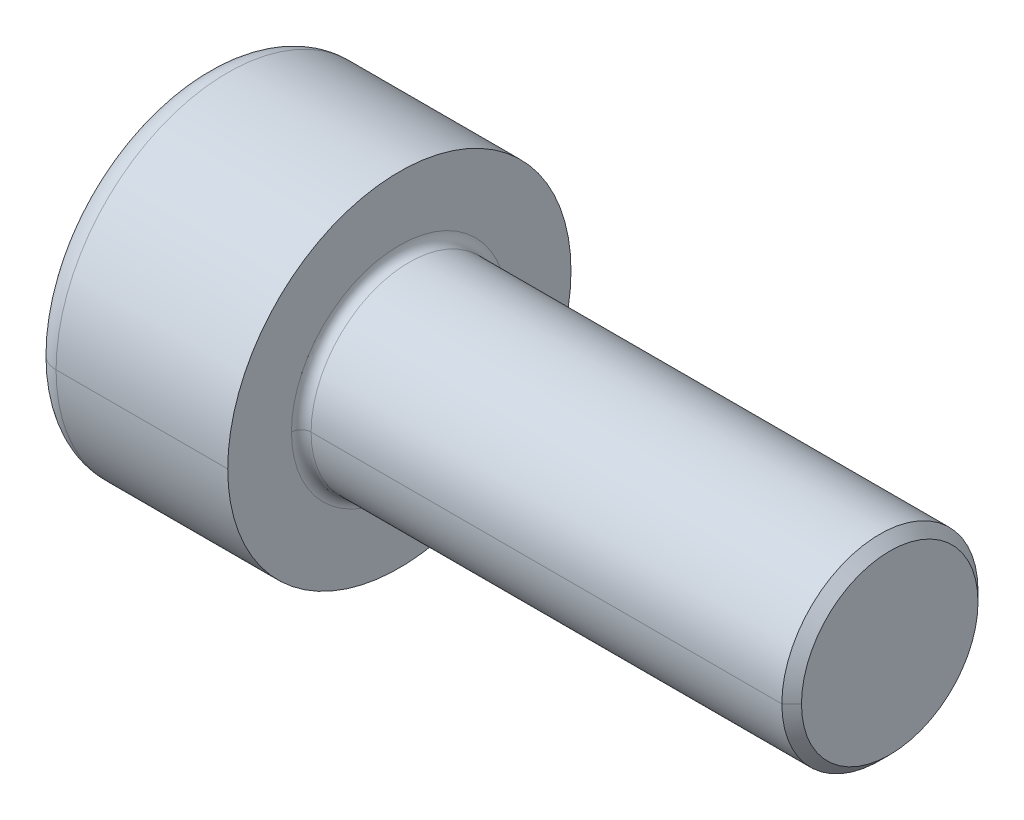
ISO-10303-21;
HEADER;
FILE_DESCRIPTION(('STEP AP214'),'2;1');
FILE_NAME('part.step','',(''),(''),'','','');
FILE_SCHEMA(('AUTOMOTIVE_DESIGN { 1 0 10303 214 1 1 1 1 }'));
ENDSEC;
DATA;
#1=APPLICATION_CONTEXT('core data for automotive mechanical design processes');
#2=APPLICATION_PROTOCOL_DEFINITION('international standard','automotive_design',2000,#1);
#3=PRODUCT_CONTEXT('',#1,'mechanical');
#4=PRODUCT('Part','Part','',(#3));
#5=PRODUCT_RELATED_PRODUCT_CATEGORY('part','',(#4));
#6=PRODUCT_DEFINITION_FORMATION('','',#4);
#7=PRODUCT_DEFINITION_CONTEXT('part definition',#1,'design');
#8=PRODUCT_DEFINITION('design','',#6,#7);
#9=PRODUCT_DEFINITION_SHAPE('','',#8);
#10=(LENGTH_UNIT() NAMED_UNIT(*) SI_UNIT(.MILLI.,.METRE.));
#11=(NAMED_UNIT(*) PLANE_ANGLE_UNIT() SI_UNIT($,.RADIAN.));
#12=(NAMED_UNIT(*) SI_UNIT($,.STERADIAN.) SOLID_ANGLE_UNIT());
#13=UNCERTAINTY_MEASURE_WITH_UNIT(LENGTH_MEASURE(1.E-05),#10,'distance_accuracy_value','');
#14=(GEOMETRIC_REPRESENTATION_CONTEXT(3) GLOBAL_UNCERTAINTY_ASSIGNED_CONTEXT((#13)) GLOBAL_UNIT_ASSIGNED_CONTEXT((#10,
#11,#12)) REPRESENTATION_CONTEXT('',''));
#15=CARTESIAN_POINT('',(0.,0.,0.));
#16=DIRECTION('',(0.,0.,1.));
#17=DIRECTION('',(1.,0.,0.));
#18=AXIS2_PLACEMENT_3D('',#15,#16,#17);
#19=CARTESIAN_POINT('',(0.,0.,0.));
#20=DIRECTION('',(1.,0.,0.));
#21=DIRECTION('',(0.,1.,0.));
#22=AXIS2_PLACEMENT_3D('',#19,#20,#21);
#23=PLANE('',#22);
#24=CARTESIAN_POINT('',(0.,0.,0.));
#25=DIRECTION('',(-1.,0.,0.));
#26=DIRECTION('',(0.,0.,-1.));
#27=AXIS2_PLACEMENT_3D('',#24,#25,#26);
#28=CIRCLE('',#27,3.);
#29=CARTESIAN_POINT('',(0.,0.,-3.));
#30=VERTEX_POINT('',#29);
#31=CARTESIAN_POINT('',(0.,0.,3.));
#32=VERTEX_POINT('',#31);
#33=EDGE_CURVE('E10',#30,#32,#28,.T.);
#34=ORIENTED_EDGE('',*,*,#33,.T.);
#35=CARTESIAN_POINT('',(0.,0.,0.));
#36=DIRECTION('',(-1.,0.,0.));
#37=DIRECTION('',(0.,0.,-1.));
#38=AXIS2_PLACEMENT_3D('',#35,#36,#37);
#39=CIRCLE('',#38,3.);
#40=EDGE_CURVE('E27',#32,#30,#39,.T.);
#41=ORIENTED_EDGE('',*,*,#40,.T.);
#42=EDGE_LOOP('',(#34,#41));
#43=FACE_BOUND('',#42,.T.);
#44=DIRECTION('',(0.,0.866025403784439,-0.5));
#45=VECTOR('',#44,1.);
#46=CARTESIAN_POINT('',(0.,-1.5,-0.866025403784437));
#47=LINE('',#46,#45);
#48=CARTESIAN_POINT('',(0.,-1.5,-0.866025403784437));
#49=VERTEX_POINT('',#48);
#50=CARTESIAN_POINT('',(0.,0.,-1.73205080756887));
#51=VERTEX_POINT('',#50);
#52=EDGE_CURVE('E195',#49,#51,#47,.T.);
#53=ORIENTED_EDGE('',*,*,#52,.T.);
#54=DIRECTION('',(0.,0.866025403784439,0.5));
#55=VECTOR('',#54,1.);
#56=CARTESIAN_POINT('',(0.,0.,-1.73205080756887));
#57=LINE('',#56,#55);
#58=CARTESIAN_POINT('',(0.,1.5,-0.866025403784437));
#59=VERTEX_POINT('',#58);
#60=EDGE_CURVE('E306',#51,#59,#57,.T.);
#61=ORIENTED_EDGE('',*,*,#60,.T.);
#62=DIRECTION('',(0.,0.,1.));
#63=VECTOR('',#62,1.);
#64=CARTESIAN_POINT('',(0.,1.5,-0.866025403784437));
#65=LINE('',#64,#63);
#66=CARTESIAN_POINT('',(0.,1.5,0.86602540378444));
#67=VERTEX_POINT('',#66);
#68=EDGE_CURVE('E310',#59,#67,#65,.T.);
#69=ORIENTED_EDGE('',*,*,#68,.T.);
#70=DIRECTION('',(0.,-0.866025403784439,0.5));
#71=VECTOR('',#70,1.);
#72=CARTESIAN_POINT('',(0.,1.5,0.86602540378444));
#73=LINE('',#72,#71);
#74=CARTESIAN_POINT('',(0.,0.,1.73205080756888));
#75=VERTEX_POINT('',#74);
#76=EDGE_CURVE('E332',#67,#75,#73,.T.);
#77=ORIENTED_EDGE('',*,*,#76,.T.);
#78=DIRECTION('',(0.,-0.866025403784439,-0.5));
#79=VECTOR('',#78,1.);
#80=CARTESIAN_POINT('',(0.,0.,1.73205080756888));
#81=LINE('',#80,#79);
#82=CARTESIAN_POINT('',(0.,-1.5,0.86602540378444));
#83=VERTEX_POINT('',#82);
#84=EDGE_CURVE('E292',#75,#83,#81,.T.);
#85=ORIENTED_EDGE('',*,*,#84,.T.);
#86=DIRECTION('',(0.,0.,-1.));
#87=VECTOR('',#86,1.);
#88=CARTESIAN_POINT('',(0.,-1.5,0.86602540378444));
#89=LINE('',#88,#87);
#90=EDGE_CURVE('E290',#83,#49,#89,.T.);
#91=ORIENTED_EDGE('',*,*,#90,.T.);
#92=EDGE_LOOP('',(#53,#61,#69,#77,#85,#91));
#93=FACE_BOUND('',#92,.T.);
#94=ADVANCED_FACE('F16',(#43,#93),#23,.F.);
#95=CARTESIAN_POINT('',(2.,1.5,-0.866025403784437));
#96=DIRECTION('',(0.,-1.,0.));
#97=DIRECTION('',(0.,0.,-1.));
#98=AXIS2_PLACEMENT_3D('',#95,#96,#97);
#99=PLANE('',#98);
#100=ORIENTED_EDGE('',*,*,#68,.F.);
#101=DIRECTION('',(-1.,0.,0.));
#102=VECTOR('',#101,1.);
#103=CARTESIAN_POINT('',(2.,1.5,-0.866025403784437));
#104=LINE('',#103,#102);
#105=CARTESIAN_POINT('',(2.,1.5,-0.866025403784437));
#106=VERTEX_POINT('',#105);
#107=EDGE_CURVE('E213',#106,#59,#104,.T.);
#108=ORIENTED_EDGE('',*,*,#107,.F.);
#109=DIRECTION('',(0.,0.,1.));
#110=VECTOR('',#109,1.);
#111=CARTESIAN_POINT('',(2.,1.5,-0.866025403784437));
#112=LINE('',#111,#110);
#113=CARTESIAN_POINT('',(2.,1.5,0.));
#114=VERTEX_POINT('',#113);
#115=EDGE_CURVE('E293',#106,#114,#112,.T.);
#116=ORIENTED_EDGE('',*,*,#115,.T.);
#117=DIRECTION('',(0.,0.,1.));
#118=VECTOR('',#117,1.);
#119=CARTESIAN_POINT('',(2.,1.5,-0.866025403784437));
#120=LINE('',#119,#118);
#121=CARTESIAN_POINT('',(2.,1.5,0.86602540378444));
#122=VERTEX_POINT('',#121);
#123=EDGE_CURVE('E275',#114,#122,#120,.T.);
#124=ORIENTED_EDGE('',*,*,#123,.T.);
#125=DIRECTION('',(-1.,0.,0.));
#126=VECTOR('',#125,1.);
#127=CARTESIAN_POINT('',(2.,1.5,0.86602540378444));
#128=LINE('',#127,#126);
#129=EDGE_CURVE('E360',#122,#67,#128,.T.);
#130=ORIENTED_EDGE('',*,*,#129,.T.);
#131=EDGE_LOOP('',(#100,#108,#116,#124,#130));
#132=FACE_BOUND('',#131,.T.);
#133=ADVANCED_FACE('F468',(#132),#99,.T.);
#134=CARTESIAN_POINT('',(0.5,0.,0.));
#135=DIRECTION('',(1.,0.,0.));
#136=DIRECTION('',(0.,0.,-1.));
#137=AXIS2_PLACEMENT_3D('',#134,#135,#136);
#138=TOROIDAL_SURFACE('',#137,3.,0.5);
#139=CARTESIAN_POINT('',(0.5,0.,3.));
#140=DIRECTION('',(0.,1.,0.));
#141=DIRECTION('',(0.,0.,1.));
#142=AXIS2_PLACEMENT_3D('',#139,#140,#141);
#143=CIRCLE('',#142,0.5);
#144=CARTESIAN_POINT('',(0.5,0.,3.5));
#145=VERTEX_POINT('',#144);
#146=EDGE_CURVE('E249',#32,#145,#143,.T.);
#147=ORIENTED_EDGE('',*,*,#146,.F.);
#148=ORIENTED_EDGE('',*,*,#33,.F.);
#149=CARTESIAN_POINT('',(0.5,0.,-3.));
#150=DIRECTION('',(0.,-1.,0.));
#151=DIRECTION('',(0.,0.,-1.));
#152=AXIS2_PLACEMENT_3D('',#149,#150,#151);
#153=CIRCLE('',#152,0.5);
#154=CARTESIAN_POINT('',(0.5,0.,-3.5));
#155=VERTEX_POINT('',#154);
#156=EDGE_CURVE('E357',#30,#155,#153,.T.);
#157=ORIENTED_EDGE('',*,*,#156,.T.);
#158=CARTESIAN_POINT('',(0.5,0.,0.));
#159=DIRECTION('',(1.,0.,0.));
#160=DIRECTION('',(0.,0.,-1.));
#161=AXIS2_PLACEMENT_3D('',#158,#159,#160);
#162=CIRCLE('',#161,3.5);
#163=EDGE_CURVE('E316',#145,#155,#162,.T.);
#164=ORIENTED_EDGE('',*,*,#163,.F.);
#165=EDGE_LOOP('',(#147,#148,#157,#164));
#166=FACE_BOUND('',#165,.T.);
#167=ADVANCED_FACE('F474',(#166),#138,.T.);
#168=CARTESIAN_POINT('',(2.,-1.5,0.86602540378444));
#169=DIRECTION('',(0.,1.,0.));
#170=DIRECTION('',(1.,0.,0.));
#171=AXIS2_PLACEMENT_3D('',#168,#169,#170);
#172=PLANE('',#171);
#173=ORIENTED_EDGE('',*,*,#90,.F.);
#174=DIRECTION('',(-1.,0.,0.));
#175=VECTOR('',#174,1.);
#176=CARTESIAN_POINT('',(2.,-1.5,0.86602540378444));
#177=LINE('',#176,#175);
#178=CARTESIAN_POINT('',(2.,-1.5,0.86602540378444));
#179=VERTEX_POINT('',#178);
#180=EDGE_CURVE('E300',#179,#83,#177,.T.);
#181=ORIENTED_EDGE('',*,*,#180,.F.);
#182=DIRECTION('',(0.,0.,-1.));
#183=VECTOR('',#182,1.);
#184=CARTESIAN_POINT('',(2.,-1.5,0.86602540378444));
#185=LINE('',#184,#183);
#186=CARTESIAN_POINT('',(2.,-1.5,0.));
#187=VERTEX_POINT('',#186);
#188=EDGE_CURVE('E205',#179,#187,#185,.T.);
#189=ORIENTED_EDGE('',*,*,#188,.T.);
#190=DIRECTION('',(0.,0.,-1.));
#191=VECTOR('',#190,1.);
#192=CARTESIAN_POINT('',(2.,-1.5,0.86602540378444));
#193=LINE('',#192,#191);
#194=CARTESIAN_POINT('',(2.,-1.5,-0.866025403784437));
#195=VERTEX_POINT('',#194);
#196=EDGE_CURVE('E198',#187,#195,#193,.T.);
#197=ORIENTED_EDGE('',*,*,#196,.T.);
#198=DIRECTION('',(-1.,0.,0.));
#199=VECTOR('',#198,1.);
#200=CARTESIAN_POINT('',(2.,-1.5,-0.866025403784437));
#201=LINE('',#200,#199);
#202=EDGE_CURVE('E187',#195,#49,#201,.T.);
#203=ORIENTED_EDGE('',*,*,#202,.T.);
#204=EDGE_LOOP('',(#173,#181,#189,#197,#203));
#205=FACE_BOUND('',#204,.T.);
#206=ADVANCED_FACE('F203',(#205),#172,.T.);
#207=CARTESIAN_POINT('',(2.,0.,1.73205080756888));
#208=DIRECTION('',(0.,0.5,-0.866025403784439));
#209=DIRECTION('',(-1.,0.,0.));
#210=AXIS2_PLACEMENT_3D('',#207,#208,#209);
#211=PLANE('',#210);
#212=ORIENTED_EDGE('',*,*,#84,.F.);
#213=DIRECTION('',(-1.,0.,0.));
#214=VECTOR('',#213,1.);
#215=CARTESIAN_POINT('',(2.,0.,1.73205080756888));
#216=LINE('',#215,#214);
#217=CARTESIAN_POINT('',(2.,0.,1.73205080756888));
#218=VERTEX_POINT('',#217);
#219=EDGE_CURVE('E289',#218,#75,#216,.T.);
#220=ORIENTED_EDGE('',*,*,#219,.F.);
#221=DIRECTION('',(0.,-0.866025403784439,-0.5));
#222=VECTOR('',#221,1.);
#223=CARTESIAN_POINT('',(2.,0.,1.73205080756888));
#224=LINE('',#223,#222);
#225=CARTESIAN_POINT('',(2.,-0.75,1.29903810567666));
#226=VERTEX_POINT('',#225);
#227=EDGE_CURVE('E199',#218,#226,#224,.T.);
#228=ORIENTED_EDGE('',*,*,#227,.T.);
#229=DIRECTION('',(0.,-0.866025403784439,-0.5));
#230=VECTOR('',#229,1.);
#231=CARTESIAN_POINT('',(2.,0.,1.73205080756888));
#232=LINE('',#231,#230);
#233=EDGE_CURVE('E304',#226,#179,#232,.T.);
#234=ORIENTED_EDGE('',*,*,#233,.T.);
#235=ORIENTED_EDGE('',*,*,#180,.T.);
#236=EDGE_LOOP('',(#212,#220,#228,#234,#235));
#237=FACE_BOUND('',#236,.T.);
#238=ADVANCED_FACE('F457',(#237),#211,.T.);
#239=CARTESIAN_POINT('',(2.,0.,-1.73205080756887));
#240=DIRECTION('',(0.,-0.5,0.866025403784439));
#241=DIRECTION('',(-1.,0.,0.));
#242=AXIS2_PLACEMENT_3D('',#239,#240,#241);
#243=PLANE('',#242);
#244=ORIENTED_EDGE('',*,*,#60,.F.);
#245=DIRECTION('',(-1.,0.,0.));
#246=VECTOR('',#245,1.);
#247=CARTESIAN_POINT('',(2.,0.,-1.73205080756887));
#248=LINE('',#247,#246);
#249=CARTESIAN_POINT('',(2.,0.,-1.73205080756887));
#250=VERTEX_POINT('',#249);
#251=EDGE_CURVE('E166',#250,#51,#248,.T.);
#252=ORIENTED_EDGE('',*,*,#251,.F.);
#253=DIRECTION('',(0.,0.866025403784439,0.5));
#254=VECTOR('',#253,1.);
#255=CARTESIAN_POINT('',(2.,0.,-1.73205080756887));
#256=LINE('',#255,#254);
#257=CARTESIAN_POINT('',(2.,0.75,-1.29903810567666));
#258=VERTEX_POINT('',#257);
#259=EDGE_CURVE('E305',#250,#258,#256,.T.);
#260=ORIENTED_EDGE('',*,*,#259,.T.);
#261=DIRECTION('',(0.,0.866025403784439,0.5));
#262=VECTOR('',#261,1.);
#263=CARTESIAN_POINT('',(2.,0.,-1.73205080756887));
#264=LINE('',#263,#262);
#265=EDGE_CURVE('E222',#258,#106,#264,.T.);
#266=ORIENTED_EDGE('',*,*,#265,.T.);
#267=ORIENTED_EDGE('',*,*,#107,.T.);
#268=EDGE_LOOP('',(#244,#252,#260,#266,#267));
#269=FACE_BOUND('',#268,.T.);
#270=ADVANCED_FACE('F455',(#269),#243,.T.);
#271=CARTESIAN_POINT('',(2.,-1.5,-0.866025403784437));
#272=DIRECTION('',(0.,0.5,0.866025403784439));
#273=DIRECTION('',(1.,0.,0.));
#274=AXIS2_PLACEMENT_3D('',#271,#272,#273);
#275=PLANE('',#274);
#276=ORIENTED_EDGE('',*,*,#52,.F.);
#277=ORIENTED_EDGE('',*,*,#202,.F.);
#278=DIRECTION('',(0.,0.866025403784439,-0.5));
#279=VECTOR('',#278,1.);
#280=CARTESIAN_POINT('',(2.,-1.5,-0.866025403784437));
#281=LINE('',#280,#279);
#282=CARTESIAN_POINT('',(2.,-0.75,-1.29903810567666));
#283=VERTEX_POINT('',#282);
#284=EDGE_CURVE('E192',#195,#283,#281,.T.);
#285=ORIENTED_EDGE('',*,*,#284,.T.);
#286=DIRECTION('',(0.,0.866025403784439,-0.5));
#287=VECTOR('',#286,1.);
#288=CARTESIAN_POINT('',(2.,-1.5,-0.866025403784437));
#289=LINE('',#288,#287);
#290=EDGE_CURVE('E214',#283,#250,#289,.T.);
#291=ORIENTED_EDGE('',*,*,#290,.T.);
#292=ORIENTED_EDGE('',*,*,#251,.T.);
#293=EDGE_LOOP('',(#276,#277,#285,#291,#292));
#294=FACE_BOUND('',#293,.T.);
#295=ADVANCED_FACE('F189',(#294),#275,.T.);
#296=CARTESIAN_POINT('',(2.,1.5,0.86602540378444));
#297=DIRECTION('',(0.,-0.5,-0.866025403784439));
#298=DIRECTION('',(0.,-0.866025403784439,0.5));
#299=AXIS2_PLACEMENT_3D('',#296,#297,#298);
#300=PLANE('',#299);
#301=ORIENTED_EDGE('',*,*,#76,.F.);
#302=ORIENTED_EDGE('',*,*,#129,.F.);
#303=DIRECTION('',(0.,-0.866025403784439,0.5));
#304=VECTOR('',#303,1.);
#305=CARTESIAN_POINT('',(2.,1.5,0.86602540378444));
#306=LINE('',#305,#304);
#307=CARTESIAN_POINT('',(2.,0.75,1.29903810567666));
#308=VERTEX_POINT('',#307);
#309=EDGE_CURVE('E355',#122,#308,#306,.T.);
#310=ORIENTED_EDGE('',*,*,#309,.T.);
#311=DIRECTION('',(0.,-0.866025403784439,0.5));
#312=VECTOR('',#311,1.);
#313=CARTESIAN_POINT('',(2.,1.5,0.86602540378444));
#314=LINE('',#313,#312);
#315=EDGE_CURVE('E228',#308,#218,#314,.T.);
#316=ORIENTED_EDGE('',*,*,#315,.T.);
#317=ORIENTED_EDGE('',*,*,#219,.T.);
#318=EDGE_LOOP('',(#301,#302,#310,#316,#317));
#319=FACE_BOUND('',#318,.T.);
#320=ADVANCED_FACE('F424',(#319),#300,.T.);
#321=CARTESIAN_POINT('',(0.5,0.,0.));
#322=DIRECTION('',(1.,0.,0.));
#323=DIRECTION('',(0.,0.,-1.));
#324=AXIS2_PLACEMENT_3D('',#321,#322,#323);
#325=TOROIDAL_SURFACE('',#324,3.,0.5);
#326=ORIENTED_EDGE('',*,*,#40,.F.);
#327=ORIENTED_EDGE('',*,*,#146,.T.);
#328=CARTESIAN_POINT('',(0.5,0.,0.));
#329=DIRECTION('',(1.,0.,0.));
#330=DIRECTION('',(0.,0.,-1.));
#331=AXIS2_PLACEMENT_3D('',#328,#329,#330);
#332=CIRCLE('',#331,3.5);
#333=EDGE_CURVE('E280',#155,#145,#332,.T.);
#334=ORIENTED_EDGE('',*,*,#333,.F.);
#335=ORIENTED_EDGE('',*,*,#156,.F.);
#336=EDGE_LOOP('',(#326,#327,#334,#335));
#337=FACE_BOUND('',#336,.T.);
#338=ADVANCED_FACE('F664',(#337),#325,.T.);
#339=CARTESIAN_POINT('',(2.,1.5,-2.59807621135332));
#340=DIRECTION('',(1.,0.,0.));
#341=DIRECTION('',(0.,1.,0.));
#342=AXIS2_PLACEMENT_3D('',#339,#340,#341);
#343=PLANE('',#342);
#344=ORIENTED_EDGE('',*,*,#123,.F.);
#345=CARTESIAN_POINT('',(2.,0.,0.));
#346=DIRECTION('',(1.,0.,0.));
#347=DIRECTION('',(0.,0.,-1.));
#348=AXIS2_PLACEMENT_3D('',#345,#346,#347);
#349=CIRCLE('',#348,1.5);
#350=EDGE_CURVE('E247',#114,#308,#349,.T.);
#351=ORIENTED_EDGE('',*,*,#350,.T.);
#352=ORIENTED_EDGE('',*,*,#309,.F.);
#353=EDGE_LOOP('',(#344,#351,#352));
#354=FACE_BOUND('',#353,.T.);
#355=ADVANCED_FACE('F668',(#354),#343,.F.);
#356=CARTESIAN_POINT('',(2.,1.5,-2.59807621135332));
#357=DIRECTION('',(1.,0.,0.));
#358=DIRECTION('',(0.,1.,0.));
#359=AXIS2_PLACEMENT_3D('',#356,#357,#358);
#360=PLANE('',#359);
#361=ORIENTED_EDGE('',*,*,#265,.F.);
#362=CARTESIAN_POINT('',(2.,0.,0.));
#363=DIRECTION('',(1.,0.,0.));
#364=DIRECTION('',(0.,0.,-1.));
#365=AXIS2_PLACEMENT_3D('',#362,#363,#364);
#366=CIRCLE('',#365,1.5);
#367=EDGE_CURVE('E250',#258,#114,#366,.T.);
#368=ORIENTED_EDGE('',*,*,#367,.T.);
#369=ORIENTED_EDGE('',*,*,#115,.F.);
#370=EDGE_LOOP('',(#361,#368,#369));
#371=FACE_BOUND('',#370,.T.);
#372=ADVANCED_FACE('F454',(#371),#360,.F.);
#373=CARTESIAN_POINT('',(4.,0.,0.));
#374=DIRECTION('',(-1.,0.,0.));
#375=DIRECTION('',(0.,0.,1.));
#376=AXIS2_PLACEMENT_3D('',#373,#374,#375);
#377=CYLINDRICAL_SURFACE('',#376,3.5);
#378=DIRECTION('',(-1.,0.,0.));
#379=VECTOR('',#378,1.);
#380=CARTESIAN_POINT('',(4.,0.,-3.5));
#381=LINE('',#380,#379);
#382=CARTESIAN_POINT('',(4.,0.,-3.5));
#383=VERTEX_POINT('',#382);
#384=EDGE_CURVE('E277',#383,#155,#381,.T.);
#385=ORIENTED_EDGE('',*,*,#384,.F.);
#386=CARTESIAN_POINT('',(4.,0.,0.));
#387=DIRECTION('',(1.,0.,0.));
#388=DIRECTION('',(0.,0.,-1.));
#389=AXIS2_PLACEMENT_3D('',#386,#387,#388);
#390=CIRCLE('',#389,3.5);
#391=CARTESIAN_POINT('',(4.,0.,3.5));
#392=VERTEX_POINT('',#391);
#393=EDGE_CURVE('E324',#392,#383,#390,.T.);
#394=ORIENTED_EDGE('',*,*,#393,.F.);
#395=DIRECTION('',(-1.,0.,0.));
#396=VECTOR('',#395,1.);
#397=CARTESIAN_POINT('',(4.,0.,3.5));
#398=LINE('',#397,#396);
#399=EDGE_CURVE('E320',#392,#145,#398,.T.);
#400=ORIENTED_EDGE('',*,*,#399,.T.);
#401=ORIENTED_EDGE('',*,*,#163,.T.);
#402=EDGE_LOOP('',(#385,#394,#400,#401));
#403=FACE_BOUND('',#402,.T.);
#404=ADVANCED_FACE('F18',(#403),#377,.T.);
#405=CARTESIAN_POINT('',(2.,1.5,-2.59807621135332));
#406=DIRECTION('',(1.,0.,0.));
#407=DIRECTION('',(0.,1.,0.));
#408=AXIS2_PLACEMENT_3D('',#405,#406,#407);
#409=PLANE('',#408);
#410=ORIENTED_EDGE('',*,*,#233,.F.);
#411=CARTESIAN_POINT('',(2.,0.,0.));
#412=DIRECTION('',(1.,0.,0.));
#413=DIRECTION('',(0.,0.,-1.));
#414=AXIS2_PLACEMENT_3D('',#411,#412,#413);
#415=CIRCLE('',#414,1.5);
#416=EDGE_CURVE('E177',#226,#187,#415,.T.);
#417=ORIENTED_EDGE('',*,*,#416,.T.);
#418=ORIENTED_EDGE('',*,*,#188,.F.);
#419=EDGE_LOOP('',(#410,#417,#418));
#420=FACE_BOUND('',#419,.T.);
#421=ADVANCED_FACE('F738',(#420),#409,.F.);
#422=CARTESIAN_POINT('',(2.,1.5,-2.59807621135332));
#423=DIRECTION('',(1.,0.,0.));
#424=DIRECTION('',(0.,1.,0.));
#425=AXIS2_PLACEMENT_3D('',#422,#423,#424);
#426=PLANE('',#425);
#427=ORIENTED_EDGE('',*,*,#196,.F.);
#428=CARTESIAN_POINT('',(2.,0.,0.));
#429=DIRECTION('',(1.,0.,0.));
#430=DIRECTION('',(0.,0.,-1.));
#431=AXIS2_PLACEMENT_3D('',#428,#429,#430);
#432=CIRCLE('',#431,1.5);
#433=EDGE_CURVE('E210',#187,#283,#432,.T.);
#434=ORIENTED_EDGE('',*,*,#433,.T.);
#435=ORIENTED_EDGE('',*,*,#284,.F.);
#436=EDGE_LOOP('',(#427,#434,#435));
#437=FACE_BOUND('',#436,.T.);
#438=ADVANCED_FACE('F209',(#437),#426,.F.);
#439=CARTESIAN_POINT('',(2.,1.5,-2.59807621135332));
#440=DIRECTION('',(1.,0.,0.));
#441=DIRECTION('',(0.,1.,0.));
#442=AXIS2_PLACEMENT_3D('',#439,#440,#441);
#443=PLANE('',#442);
#444=ORIENTED_EDGE('',*,*,#315,.F.);
#445=CARTESIAN_POINT('',(2.,0.,0.));
#446=DIRECTION('',(1.,0.,0.));
#447=DIRECTION('',(0.,0.,-1.));
#448=AXIS2_PLACEMENT_3D('',#445,#446,#447);
#449=CIRCLE('',#448,1.5);
#450=CARTESIAN_POINT('',(2.,0.,1.5));
#451=VERTEX_POINT('',#450);
#452=EDGE_CURVE('E284',#308,#451,#449,.T.);
#453=ORIENTED_EDGE('',*,*,#452,.T.);
#454=CARTESIAN_POINT('',(2.,0.,0.));
#455=DIRECTION('',(1.,0.,0.));
#456=DIRECTION('',(0.,0.,-1.));
#457=AXIS2_PLACEMENT_3D('',#454,#455,#456);
#458=CIRCLE('',#457,1.5);
#459=EDGE_CURVE('E281',#451,#226,#458,.T.);
#460=ORIENTED_EDGE('',*,*,#459,.T.);
#461=ORIENTED_EDGE('',*,*,#227,.F.);
#462=EDGE_LOOP('',(#444,#453,#460,#461));
#463=FACE_BOUND('',#462,.T.);
#464=ADVANCED_FACE('F426',(#463),#443,.F.);
#465=CARTESIAN_POINT('',(2.,1.5,-2.59807621135332));
#466=DIRECTION('',(1.,0.,0.));
#467=DIRECTION('',(0.,1.,0.));
#468=AXIS2_PLACEMENT_3D('',#465,#466,#467);
#469=PLANE('',#468);
#470=ORIENTED_EDGE('',*,*,#290,.F.);
#471=CARTESIAN_POINT('',(2.,0.,0.));
#472=DIRECTION('',(1.,0.,0.));
#473=DIRECTION('',(0.,0.,-1.));
#474=AXIS2_PLACEMENT_3D('',#471,#472,#473);
#475=CIRCLE('',#474,1.5);
#476=CARTESIAN_POINT('',(2.,0.,-1.5));
#477=VERTEX_POINT('',#476);
#478=EDGE_CURVE('E285',#283,#477,#475,.T.);
#479=ORIENTED_EDGE('',*,*,#478,.T.);
#480=CARTESIAN_POINT('',(2.,0.,0.));
#481=DIRECTION('',(1.,0.,0.));
#482=DIRECTION('',(0.,0.,-1.));
#483=AXIS2_PLACEMENT_3D('',#480,#481,#482);
#484=CIRCLE('',#483,1.5);
#485=EDGE_CURVE('E20',#477,#258,#484,.T.);
#486=ORIENTED_EDGE('',*,*,#485,.T.);
#487=ORIENTED_EDGE('',*,*,#259,.F.);
#488=EDGE_LOOP('',(#470,#479,#486,#487));
#489=FACE_BOUND('',#488,.T.);
#490=ADVANCED_FACE('F445',(#489),#469,.F.);
#491=CARTESIAN_POINT('',(4.,0.,0.));
#492=DIRECTION('',(-1.,0.,0.));
#493=DIRECTION('',(0.,0.,1.));
#494=AXIS2_PLACEMENT_3D('',#491,#492,#493);
#495=CYLINDRICAL_SURFACE('',#494,3.5);
#496=CARTESIAN_POINT('',(4.,0.,0.));
#497=DIRECTION('',(1.,0.,0.));
#498=DIRECTION('',(0.,0.,-1.));
#499=AXIS2_PLACEMENT_3D('',#496,#497,#498);
#500=CIRCLE('',#499,3.5);
#501=EDGE_CURVE('E381',#383,#392,#500,.T.);
#502=ORIENTED_EDGE('',*,*,#501,.F.);
#503=ORIENTED_EDGE('',*,*,#384,.T.);
#504=ORIENTED_EDGE('',*,*,#333,.T.);
#505=ORIENTED_EDGE('',*,*,#399,.F.);
#506=EDGE_LOOP('',(#502,#503,#504,#505));
#507=FACE_BOUND('',#506,.T.);
#508=ADVANCED_FACE('F480',(#507),#495,.T.);
#509=CARTESIAN_POINT('',(2.,0.,0.));
#510=DIRECTION('',(-1.,0.,0.));
#511=DIRECTION('',(0.,0.,1.));
#512=AXIS2_PLACEMENT_3D('',#509,#510,#511);
#513=CONICAL_SURFACE('',#512,1.5,1.0471975511966);
#514=DIRECTION('',(-0.5,0.,-0.866025403784436));
#515=VECTOR('',#514,1.);
#516=CARTESIAN_POINT('',(2.,0.,-1.5));
#517=LINE('',#516,#515);
#518=CARTESIAN_POINT('',(2.86602540378445,0.,0.));
#519=VERTEX_POINT('',#518);
#520=EDGE_CURVE('E235',#519,#477,#517,.T.);
#521=ORIENTED_EDGE('',*,*,#520,.F.);
#522=DIRECTION('',(-0.5,0.,0.866025403784436));
#523=VECTOR('',#522,1.);
#524=CARTESIAN_POINT('',(2.,0.,1.5));
#525=LINE('',#524,#523);
#526=EDGE_CURVE('E321',#519,#451,#525,.T.);
#527=ORIENTED_EDGE('',*,*,#526,.T.);
#528=ORIENTED_EDGE('',*,*,#452,.F.);
#529=ORIENTED_EDGE('',*,*,#350,.F.);
#530=ORIENTED_EDGE('',*,*,#367,.F.);
#531=ORIENTED_EDGE('',*,*,#485,.F.);
#532=EDGE_LOOP('',(#521,#527,#528,#529,#530,#531));
#533=FACE_BOUND('',#532,.T.);
#534=ADVANCED_FACE('F447',(#533),#513,.F.);
#535=CARTESIAN_POINT('',(4.,0.,0.));
#536=DIRECTION('',(1.,0.,0.));
#537=DIRECTION('',(0.,1.,0.));
#538=AXIS2_PLACEMENT_3D('',#535,#536,#537);
#539=PLANE('',#538);
#540=ORIENTED_EDGE('',*,*,#393,.T.);
#541=ORIENTED_EDGE('',*,*,#501,.T.);
#542=EDGE_LOOP('',(#540,#541));
#543=FACE_BOUND('',#542,.T.);
#544=CARTESIAN_POINT('',(4.,0.,0.));
#545=DIRECTION('',(-1.,0.,0.));
#546=DIRECTION('',(0.,0.,-1.));
#547=AXIS2_PLACEMENT_3D('',#544,#545,#546);
#548=CIRCLE('',#547,2.2);
#549=CARTESIAN_POINT('',(4.,0.,-2.2));
#550=VERTEX_POINT('',#549);
#551=CARTESIAN_POINT('',(4.,0.,2.2));
#552=VERTEX_POINT('',#551);
#553=EDGE_CURVE('E384',#550,#552,#548,.T.);
#554=ORIENTED_EDGE('',*,*,#553,.T.);
#555=CARTESIAN_POINT('',(4.,0.,0.));
#556=DIRECTION('',(-1.,0.,0.));
#557=DIRECTION('',(0.,0.,-1.));
#558=AXIS2_PLACEMENT_3D('',#555,#556,#557);
#559=CIRCLE('',#558,2.2);
#560=EDGE_CURVE('E238',#552,#550,#559,.T.);
#561=ORIENTED_EDGE('',*,*,#560,.T.);
#562=EDGE_LOOP('',(#554,#561));
#563=FACE_BOUND('',#562,.T.);
#564=ADVANCED_FACE('F763',(#543,#563),#539,.T.);
#565=CARTESIAN_POINT('',(2.,0.,0.));
#566=DIRECTION('',(-1.,0.,0.));
#567=DIRECTION('',(0.,0.,1.));
#568=AXIS2_PLACEMENT_3D('',#565,#566,#567);
#569=CONICAL_SURFACE('',#568,1.5,1.0471975511966);
#570=ORIENTED_EDGE('',*,*,#526,.F.);
#571=ORIENTED_EDGE('',*,*,#520,.T.);
#572=ORIENTED_EDGE('',*,*,#478,.F.);
#573=ORIENTED_EDGE('',*,*,#433,.F.);
#574=ORIENTED_EDGE('',*,*,#416,.F.);
#575=ORIENTED_EDGE('',*,*,#459,.F.);
#576=EDGE_LOOP('',(#570,#571,#572,#573,#574,#575));
#577=FACE_BOUND('',#576,.T.);
#578=ADVANCED_FACE('F495',(#577),#569,.F.);
#579=CARTESIAN_POINT('',(4.2,0.,0.));
#580=DIRECTION('',(1.,0.,0.));
#581=DIRECTION('',(0.,0.,-1.));
#582=AXIS2_PLACEMENT_3D('',#579,#580,#581);
#583=TOROIDAL_SURFACE('',#582,2.2,0.2);
#584=CARTESIAN_POINT('',(4.2,0.,2.2));
#585=DIRECTION('',(0.,1.,0.));
#586=DIRECTION('',(0.,0.,1.));
#587=AXIS2_PLACEMENT_3D('',#584,#585,#586);
#588=CIRCLE('',#587,0.2);
#589=CARTESIAN_POINT('',(4.2,0.,2.));
#590=VERTEX_POINT('',#589);
#591=EDGE_CURVE('E271',#590,#552,#588,.T.);
#592=ORIENTED_EDGE('',*,*,#591,.F.);
#593=CARTESIAN_POINT('',(4.2,0.,0.));
#594=DIRECTION('',(1.,0.,0.));
#595=DIRECTION('',(0.,0.,-1.));
#596=AXIS2_PLACEMENT_3D('',#593,#594,#595);
#597=CIRCLE('',#596,2.);
#598=CARTESIAN_POINT('',(4.2,0.,-2.));
#599=VERTEX_POINT('',#598);
#600=EDGE_CURVE('E245',#599,#590,#597,.T.);
#601=ORIENTED_EDGE('',*,*,#600,.F.);
#602=CARTESIAN_POINT('',(4.2,0.,-2.2));
#603=DIRECTION('',(0.,-1.,0.));
#604=DIRECTION('',(0.,0.,-1.));
#605=AXIS2_PLACEMENT_3D('',#602,#603,#604);
#606=CIRCLE('',#605,0.2);
#607=EDGE_CURVE('E239',#599,#550,#606,.T.);
#608=ORIENTED_EDGE('',*,*,#607,.T.);
#609=ORIENTED_EDGE('',*,*,#560,.F.);
#610=EDGE_LOOP('',(#592,#601,#608,#609));
#611=FACE_BOUND('',#610,.T.);
#612=ADVANCED_FACE('F487',(#611),#583,.F.);
#613=CARTESIAN_POINT('',(4.2,0.,0.));
#614=DIRECTION('',(1.,0.,0.));
#615=DIRECTION('',(0.,0.,-1.));
#616=AXIS2_PLACEMENT_3D('',#613,#614,#615);
#617=TOROIDAL_SURFACE('',#616,2.2,0.2);
#618=CARTESIAN_POINT('',(4.2,0.,0.));
#619=DIRECTION('',(1.,0.,0.));
#620=DIRECTION('',(0.,0.,-1.));
#621=AXIS2_PLACEMENT_3D('',#618,#619,#620);
#622=CIRCLE('',#621,2.);
#623=EDGE_CURVE('E298',#590,#599,#622,.T.);
#624=ORIENTED_EDGE('',*,*,#623,.F.);
#625=ORIENTED_EDGE('',*,*,#591,.T.);
#626=ORIENTED_EDGE('',*,*,#553,.F.);
#627=ORIENTED_EDGE('',*,*,#607,.F.);
#628=EDGE_LOOP('',(#624,#625,#626,#627));
#629=FACE_BOUND('',#628,.T.);
#630=ADVANCED_FACE('F484',(#629),#617,.F.);
#631=CARTESIAN_POINT('',(14.,0.,0.));
#632=DIRECTION('',(-1.,0.,0.));
#633=DIRECTION('',(0.,0.,1.));
#634=AXIS2_PLACEMENT_3D('',#631,#632,#633);
#635=CYLINDRICAL_SURFACE('',#634,2.);
#636=CARTESIAN_POINT('',(13.8,0.,0.));
#637=DIRECTION('',(-1.,0.,0.));
#638=DIRECTION('',(0.,0.,-1.));
#639=AXIS2_PLACEMENT_3D('',#636,#637,#638);
#640=CIRCLE('',#639,2.);
#641=CARTESIAN_POINT('',(13.8,0.,2.));
#642=VERTEX_POINT('',#641);
#643=CARTESIAN_POINT('',(13.8,0.,-2.));
#644=VERTEX_POINT('',#643);
#645=EDGE_CURVE('E262',#642,#644,#640,.T.);
#646=ORIENTED_EDGE('',*,*,#645,.T.);
#647=DIRECTION('',(-1.,0.,0.));
#648=VECTOR('',#647,1.);
#649=CARTESIAN_POINT('',(14.,0.,-2.));
#650=LINE('',#649,#648);
#651=EDGE_CURVE('E253',#644,#599,#650,.T.);
#652=ORIENTED_EDGE('',*,*,#651,.T.);
#653=ORIENTED_EDGE('',*,*,#600,.T.);
#654=DIRECTION('',(-1.,0.,0.));
#655=VECTOR('',#654,1.);
#656=CARTESIAN_POINT('',(14.,0.,2.));
#657=LINE('',#656,#655);
#658=EDGE_CURVE('E246',#642,#590,#657,.T.);
#659=ORIENTED_EDGE('',*,*,#658,.F.);
#660=EDGE_LOOP('',(#646,#652,#653,#659));
#661=FACE_BOUND('',#660,.T.);
#662=ADVANCED_FACE('F486',(#661),#635,.T.);
#663=CARTESIAN_POINT('',(14.,0.,0.));
#664=DIRECTION('',(-1.,0.,0.));
#665=DIRECTION('',(0.,0.,1.));
#666=AXIS2_PLACEMENT_3D('',#663,#664,#665);
#667=CYLINDRICAL_SURFACE('',#666,2.);
#668=ORIENTED_EDGE('',*,*,#651,.F.);
#669=CARTESIAN_POINT('',(13.8,0.,0.));
#670=DIRECTION('',(-1.,0.,0.));
#671=DIRECTION('',(0.,0.,-1.));
#672=AXIS2_PLACEMENT_3D('',#669,#670,#671);
#673=CIRCLE('',#672,2.);
#674=EDGE_CURVE('E241',#644,#642,#673,.T.);
#675=ORIENTED_EDGE('',*,*,#674,.T.);
#676=ORIENTED_EDGE('',*,*,#658,.T.);
#677=ORIENTED_EDGE('',*,*,#623,.T.);
#678=EDGE_LOOP('',(#668,#675,#676,#677));
#679=FACE_BOUND('',#678,.T.);
#680=ADVANCED_FACE('F493',(#679),#667,.T.);
#681=CARTESIAN_POINT('',(14.,0.,0.));
#682=DIRECTION('',(-1.,0.,0.));
#683=DIRECTION('',(0.,0.,1.));
#684=AXIS2_PLACEMENT_3D('',#681,#682,#683);
#685=CONICAL_SURFACE('',#684,1.8,0.785398163397443);
#686=CARTESIAN_POINT('',(14.,0.,0.));
#687=DIRECTION('',(1.,0.,0.));
#688=DIRECTION('',(0.,0.,-1.));
#689=AXIS2_PLACEMENT_3D('',#686,#687,#688);
#690=CIRCLE('',#689,1.8);
#691=CARTESIAN_POINT('',(14.,0.,-1.8));
#692=VERTEX_POINT('',#691);
#693=CARTESIAN_POINT('',(14.,0.,1.8));
#694=VERTEX_POINT('',#693);
#695=EDGE_CURVE('E234',#692,#694,#690,.T.);
#696=ORIENTED_EDGE('',*,*,#695,.F.);
#697=DIRECTION('',(-0.707106781186551,0.,-0.707106781186545));
#698=VECTOR('',#697,1.);
#699=CARTESIAN_POINT('',(14.,0.,-1.8));
#700=LINE('',#699,#698);
#701=EDGE_CURVE('E295',#692,#644,#700,.T.);
#702=ORIENTED_EDGE('',*,*,#701,.T.);
#703=ORIENTED_EDGE('',*,*,#645,.F.);
#704=DIRECTION('',(-0.707106781186551,0.,0.707106781186545));
#705=VECTOR('',#704,1.);
#706=CARTESIAN_POINT('',(14.,0.,1.8));
#707=LINE('',#706,#705);
#708=EDGE_CURVE('E233',#694,#642,#707,.T.);
#709=ORIENTED_EDGE('',*,*,#708,.F.);
#710=EDGE_LOOP('',(#696,#702,#703,#709));
#711=FACE_BOUND('',#710,.T.);
#712=ADVANCED_FACE('F729',(#711),#685,.T.);
#713=CARTESIAN_POINT('',(14.,0.,0.));
#714=DIRECTION('',(-1.,0.,0.));
#715=DIRECTION('',(0.,0.,1.));
#716=AXIS2_PLACEMENT_3D('',#713,#714,#715);
#717=CONICAL_SURFACE('',#716,1.8,0.785398163397443);
#718=ORIENTED_EDGE('',*,*,#701,.F.);
#719=CARTESIAN_POINT('',(14.,0.,0.));
#720=DIRECTION('',(1.,0.,0.));
#721=DIRECTION('',(0.,0.,-1.));
#722=AXIS2_PLACEMENT_3D('',#719,#720,#721);
#723=CIRCLE('',#722,1.8);
#724=EDGE_CURVE('E230',#694,#692,#723,.T.);
#725=ORIENTED_EDGE('',*,*,#724,.F.);
#726=ORIENTED_EDGE('',*,*,#708,.T.);
#727=ORIENTED_EDGE('',*,*,#674,.F.);
#728=EDGE_LOOP('',(#718,#725,#726,#727));
#729=FACE_BOUND('',#728,.T.);
#730=ADVANCED_FACE('F677',(#729),#717,.T.);
#731=CARTESIAN_POINT('',(14.,0.,0.));
#732=DIRECTION('',(1.,0.,0.));
#733=DIRECTION('',(0.,1.,0.));
#734=AXIS2_PLACEMENT_3D('',#731,#732,#733);
#735=PLANE('',#734);
#736=ORIENTED_EDGE('',*,*,#724,.T.);
#737=ORIENTED_EDGE('',*,*,#695,.T.);
#738=EDGE_LOOP('',(#736,#737));
#739=FACE_BOUND('',#738,.T.);
#740=ADVANCED_FACE('F673',(#739),#735,.T.);
#741=CLOSED_SHELL('',(#94,#133,#167,#206,#238,#270,#295,#320,#338,#355,#372,#404,#421,#438,#464,
#490,#508,#534,#564,#578,#612,#630,#662,#680,#712,#730,#740));
#742=MANIFOLD_SOLID_BREP('B1',#741);
#743=ADVANCED_BREP_SHAPE_REPRESENTATION('',(#18,#742),#14);
#744=SHAPE_DEFINITION_REPRESENTATION(#9,#743);
ENDSEC;
END-ISO-10303-21;
